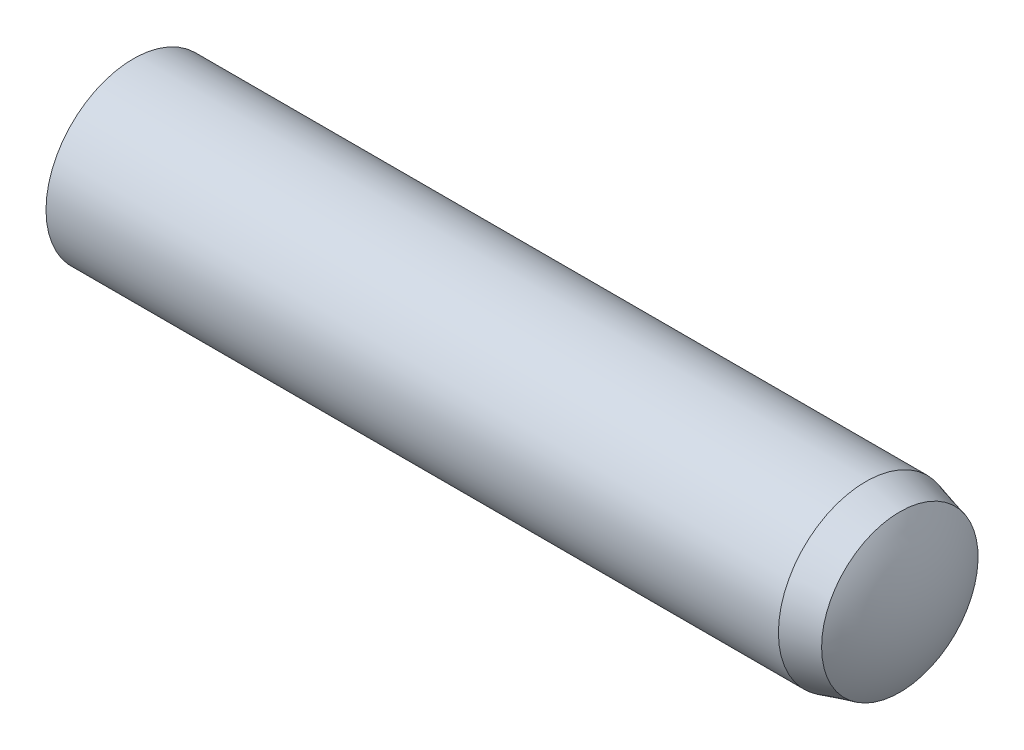
ISO-10303-21;
HEADER;
FILE_DESCRIPTION(('STEP AP214'),'2;1');
FILE_NAME('part.step','',(''),(''),'','','');
FILE_SCHEMA(('AUTOMOTIVE_DESIGN { 1 0 10303 214 1 1 1 1 }'));
ENDSEC;
DATA;
#1=APPLICATION_CONTEXT('core data for automotive mechanical design processes');
#2=APPLICATION_PROTOCOL_DEFINITION('international standard','automotive_design',2000,#1);
#3=PRODUCT_CONTEXT('',#1,'mechanical');
#4=PRODUCT('Part','Part','',(#3));
#5=PRODUCT_RELATED_PRODUCT_CATEGORY('part','',(#4));
#6=PRODUCT_DEFINITION_FORMATION('','',#4);
#7=PRODUCT_DEFINITION_CONTEXT('part definition',#1,'design');
#8=PRODUCT_DEFINITION('design','',#6,#7);
#9=PRODUCT_DEFINITION_SHAPE('','',#8);
#10=(LENGTH_UNIT() NAMED_UNIT(*) SI_UNIT(.MILLI.,.METRE.));
#11=(NAMED_UNIT(*) PLANE_ANGLE_UNIT() SI_UNIT($,.RADIAN.));
#12=(NAMED_UNIT(*) SI_UNIT($,.STERADIAN.) SOLID_ANGLE_UNIT());
#13=UNCERTAINTY_MEASURE_WITH_UNIT(LENGTH_MEASURE(1.E-05),#10,'distance_accuracy_value','');
#14=(GEOMETRIC_REPRESENTATION_CONTEXT(3) GLOBAL_UNCERTAINTY_ASSIGNED_CONTEXT((#13)) GLOBAL_UNIT_ASSIGNED_CONTEXT((#10,
#11,#12)) REPRESENTATION_CONTEXT('',''));
#15=CARTESIAN_POINT('',(0.,0.,0.));
#16=DIRECTION('',(0.,0.,1.));
#17=DIRECTION('',(1.,0.,0.));
#18=AXIS2_PLACEMENT_3D('',#15,#16,#17);
#19=CARTESIAN_POINT('',(-7.,0.,0.));
#20=DIRECTION('',(1.,0.,0.));
#21=DIRECTION('',(0.,0.,-1.));
#22=AXIS2_PLACEMENT_3D('',#19,#20,#21);
#23=CYLINDRICAL_SURFACE('',#22,1.5);
#24=CARTESIAN_POINT('',(6.025,0.,0.));
#25=DIRECTION('',(-1.,0.,0.));
#26=DIRECTION('',(0.,0.,1.));
#27=AXIS2_PLACEMENT_3D('',#24,#25,#26);
#28=CIRCLE('',#27,1.49999999999999);
#29=CARTESIAN_POINT('',(6.025,0.,1.49999999999999));
#30=VERTEX_POINT('',#29);
#31=EDGE_CURVE('E11',#30,#30,#28,.T.);
#32=ORIENTED_EDGE('',*,*,#31,.T.);
#33=EDGE_LOOP('',(#32));
#34=FACE_BOUND('',#33,.T.);
#35=CARTESIAN_POINT('',(-6.55,0.,0.));
#36=DIRECTION('',(-1.,0.,0.));
#37=DIRECTION('',(0.,0.,1.));
#38=AXIS2_PLACEMENT_3D('',#35,#36,#37);
#39=CIRCLE('',#38,1.5);
#40=CARTESIAN_POINT('',(-6.55,0.,1.5));
#41=VERTEX_POINT('',#40);
#42=EDGE_CURVE('E54',#41,#41,#39,.T.);
#43=ORIENTED_EDGE('',*,*,#42,.F.);
#44=EDGE_LOOP('',(#43));
#45=FACE_BOUND('',#44,.T.);
#46=ADVANCED_FACE('F34',(#34,#45),#23,.T.);
#47=CARTESIAN_POINT('',(6.025,0.,0.));
#48=DIRECTION('',(-1.,0.,0.));
#49=DIRECTION('',(0.,0.,1.));
#50=AXIS2_PLACEMENT_3D('',#47,#48,#49);
#51=CONICAL_SURFACE('',#50,1.49999999999999,0.261799387799149);
#52=CARTESIAN_POINT('',(6.60999999999999,0.,0.));
#53=DIRECTION('',(-1.,0.,0.));
#54=DIRECTION('',(0.,0.,1.));
#55=AXIS2_PLACEMENT_3D('',#52,#53,#54);
#56=CIRCLE('',#55,1.34324972242779);
#57=CARTESIAN_POINT('',(6.60999999999999,0.,1.34324972242779));
#58=VERTEX_POINT('',#57);
#59=EDGE_CURVE('E41',#58,#58,#56,.T.);
#60=ORIENTED_EDGE('',*,*,#59,.T.);
#61=EDGE_LOOP('',(#60));
#62=FACE_BOUND('',#61,.T.);
#63=ORIENTED_EDGE('',*,*,#31,.F.);
#64=EDGE_LOOP('',(#63));
#65=FACE_BOUND('',#64,.T.);
#66=ADVANCED_FACE('F60',(#62,#65),#51,.T.);
#67=CARTESIAN_POINT('',(4.49176946563807,0.,0.));
#68=DIRECTION('',(-1.,0.,0.));
#69=DIRECTION('',(0.,1.,0.));
#70=AXIS2_PLACEMENT_3D('',#67,#68,#69);
#71=SPHERICAL_SURFACE('',#70,2.50823053436193);
#72=CARTESIAN_POINT('',(7.,0.,0.));
#73=VERTEX_POINT('',#72);
#74=VERTEX_LOOP('',#73);
#75=FACE_BOUND('',#74,.T.);
#76=ORIENTED_EDGE('',*,*,#59,.F.);
#77=EDGE_LOOP('',(#76));
#78=FACE_BOUND('',#77,.T.);
#79=ADVANCED_FACE('F50',(#75,#78),#71,.T.);
#80=CARTESIAN_POINT('',(-4.275,0.,0.));
#81=DIRECTION('',(-1.,0.,0.));
#82=DIRECTION('',(0.,-1.,0.));
#83=AXIS2_PLACEMENT_3D('',#80,#81,#82);
#84=SPHERICAL_SURFACE('',#83,2.725);
#85=CARTESIAN_POINT('',(-7.,0.,0.));
#86=VERTEX_POINT('',#85);
#87=VERTEX_LOOP('',#86);
#88=FACE_BOUND('',#87,.T.);
#89=ORIENTED_EDGE('',*,*,#42,.T.);
#90=EDGE_LOOP('',(#89));
#91=FACE_BOUND('',#90,.T.);
#92=ADVANCED_FACE('F47',(#88,#91),#84,.T.);
#93=CLOSED_SHELL('',(#46,#66,#79,#92));
#94=MANIFOLD_SOLID_BREP('B2',#93);
#95=ADVANCED_BREP_SHAPE_REPRESENTATION('',(#18,#94),#14);
#96=SHAPE_DEFINITION_REPRESENTATION(#9,#95);
ENDSEC;
END-ISO-10303-21;
